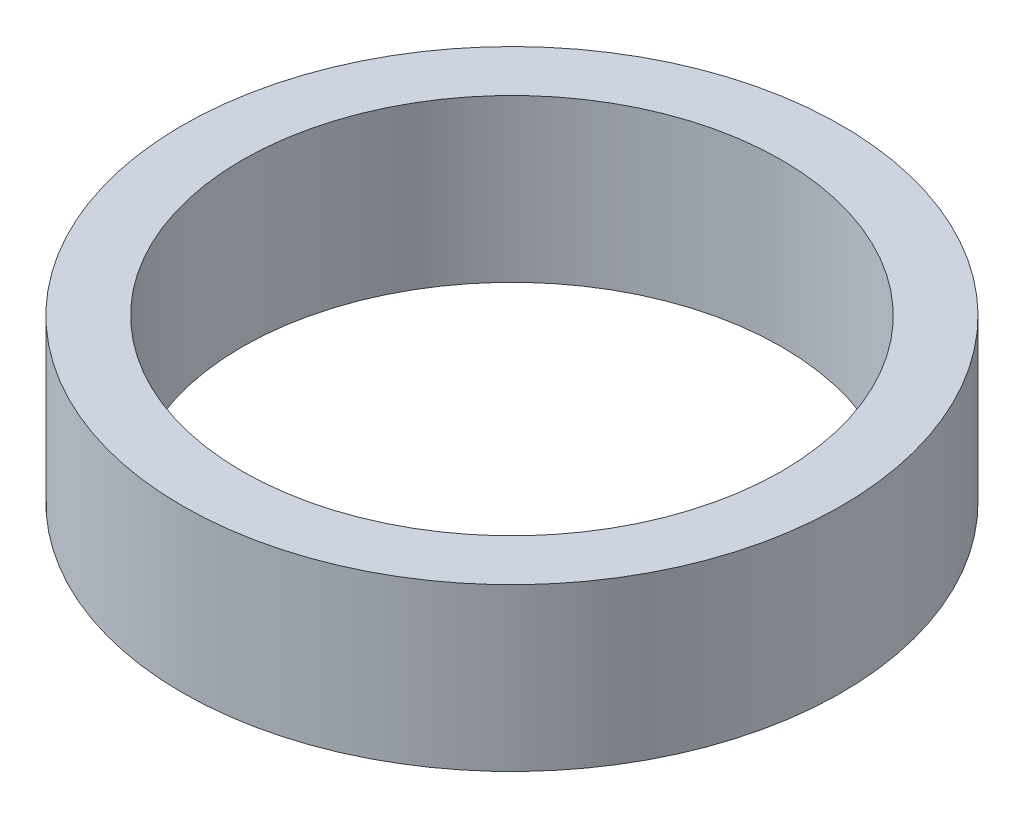
ISO-10303-21;
HEADER;
FILE_DESCRIPTION(('STEP AP214'),'2;1');
FILE_NAME('part.step','',(''),(''),'','','');
FILE_SCHEMA(('AUTOMOTIVE_DESIGN { 1 0 10303 214 1 1 1 1 }'));
ENDSEC;
DATA;
#1=APPLICATION_CONTEXT('core data for automotive mechanical design processes');
#2=APPLICATION_PROTOCOL_DEFINITION('international standard','automotive_design',2000,#1);
#3=PRODUCT_CONTEXT('',#1,'mechanical');
#4=PRODUCT('Part','Part','',(#3));
#5=PRODUCT_RELATED_PRODUCT_CATEGORY('part','',(#4));
#6=PRODUCT_DEFINITION_FORMATION('','',#4);
#7=PRODUCT_DEFINITION_CONTEXT('part definition',#1,'design');
#8=PRODUCT_DEFINITION('design','',#6,#7);
#9=PRODUCT_DEFINITION_SHAPE('','',#8);
#10=(LENGTH_UNIT() NAMED_UNIT(*) SI_UNIT(.MILLI.,.METRE.));
#11=(NAMED_UNIT(*) PLANE_ANGLE_UNIT() SI_UNIT($,.RADIAN.));
#12=(NAMED_UNIT(*) SI_UNIT($,.STERADIAN.) SOLID_ANGLE_UNIT());
#13=UNCERTAINTY_MEASURE_WITH_UNIT(LENGTH_MEASURE(1.E-05),#10,'distance_accuracy_value','');
#14=(GEOMETRIC_REPRESENTATION_CONTEXT(3) GLOBAL_UNCERTAINTY_ASSIGNED_CONTEXT((#13)) GLOBAL_UNIT_ASSIGNED_CONTEXT((#10,
#11,#12)) REPRESENTATION_CONTEXT('',''));
#15=CARTESIAN_POINT('',(0.,0.,0.));
#16=DIRECTION('',(0.,0.,1.));
#17=DIRECTION('',(1.,0.,0.));
#18=AXIS2_PLACEMENT_3D('',#15,#16,#17);
#19=CARTESIAN_POINT('',(0.,27.,0.));
#20=DIRECTION('',(0.,-1.,0.));
#21=DIRECTION('',(0.,0.,-1.));
#22=AXIS2_PLACEMENT_3D('',#19,#20,#21);
#23=CYLINDRICAL_SURFACE('',#22,55.);
#24=CARTESIAN_POINT('',(0.,27.,0.));
#25=DIRECTION('',(0.,1.,0.));
#26=DIRECTION('',(0.,0.,1.));
#27=AXIS2_PLACEMENT_3D('',#24,#25,#26);
#28=CIRCLE('',#27,55.);
#29=CARTESIAN_POINT('',(0.,27.,55.));
#30=VERTEX_POINT('',#29);
#31=EDGE_CURVE('E10',#30,#30,#28,.T.);
#32=ORIENTED_EDGE('',*,*,#31,.F.);
#33=EDGE_LOOP('',(#32));
#34=FACE_BOUND('',#33,.T.);
#35=CARTESIAN_POINT('',(0.,0.,0.));
#36=DIRECTION('',(0.,1.,0.));
#37=DIRECTION('',(0.,0.,1.));
#38=AXIS2_PLACEMENT_3D('',#35,#36,#37);
#39=CIRCLE('',#38,55.);
#40=CARTESIAN_POINT('',(0.,0.,55.));
#41=VERTEX_POINT('',#40);
#42=EDGE_CURVE('E37',#41,#41,#39,.T.);
#43=ORIENTED_EDGE('',*,*,#42,.T.);
#44=EDGE_LOOP('',(#43));
#45=FACE_BOUND('',#44,.T.);
#46=ADVANCED_FACE('F40',(#34,#45),#23,.T.);
#47=CARTESIAN_POINT('',(0.,27.,0.));
#48=DIRECTION('',(0.,1.,0.));
#49=DIRECTION('',(0.,0.,1.));
#50=AXIS2_PLACEMENT_3D('',#47,#48,#49);
#51=PLANE('',#50);
#52=CARTESIAN_POINT('',(0.,27.,0.));
#53=DIRECTION('',(0.,1.,0.));
#54=DIRECTION('',(0.,0.,1.));
#55=AXIS2_PLACEMENT_3D('',#52,#53,#54);
#56=CIRCLE('',#55,45.);
#57=CARTESIAN_POINT('',(0.,27.,45.));
#58=VERTEX_POINT('',#57);
#59=EDGE_CURVE('E50',#58,#58,#56,.T.);
#60=ORIENTED_EDGE('',*,*,#59,.F.);
#61=EDGE_LOOP('',(#60));
#62=FACE_BOUND('',#61,.T.);
#63=ORIENTED_EDGE('',*,*,#31,.T.);
#64=EDGE_LOOP('',(#63));
#65=FACE_BOUND('',#64,.T.);
#66=ADVANCED_FACE('F59',(#62,#65),#51,.T.);
#67=CARTESIAN_POINT('',(0.,0.,0.));
#68=DIRECTION('',(0.,1.,0.));
#69=DIRECTION('',(0.,0.,1.));
#70=AXIS2_PLACEMENT_3D('',#67,#68,#69);
#71=PLANE('',#70);
#72=CARTESIAN_POINT('',(0.,0.,0.));
#73=DIRECTION('',(0.,1.,0.));
#74=DIRECTION('',(0.,0.,1.));
#75=AXIS2_PLACEMENT_3D('',#72,#73,#74);
#76=CIRCLE('',#75,45.);
#77=CARTESIAN_POINT('',(0.,0.,45.));
#78=VERTEX_POINT('',#77);
#79=EDGE_CURVE('E47',#78,#78,#76,.T.);
#80=ORIENTED_EDGE('',*,*,#79,.T.);
#81=EDGE_LOOP('',(#80));
#82=FACE_BOUND('',#81,.T.);
#83=ORIENTED_EDGE('',*,*,#42,.F.);
#84=EDGE_LOOP('',(#83));
#85=FACE_BOUND('',#84,.T.);
#86=ADVANCED_FACE('F58',(#82,#85),#71,.F.);
#87=CARTESIAN_POINT('',(0.,27.,0.));
#88=DIRECTION('',(0.,-1.,0.));
#89=DIRECTION('',(0.,0.,-1.));
#90=AXIS2_PLACEMENT_3D('',#87,#88,#89);
#91=CYLINDRICAL_SURFACE('',#90,45.);
#92=ORIENTED_EDGE('',*,*,#59,.T.);
#93=EDGE_LOOP('',(#92));
#94=FACE_BOUND('',#93,.T.);
#95=ORIENTED_EDGE('',*,*,#79,.F.);
#96=EDGE_LOOP('',(#95));
#97=FACE_BOUND('',#96,.T.);
#98=ADVANCED_FACE('F54',(#94,#97),#91,.F.);
#99=CLOSED_SHELL('',(#46,#66,#86,#98));
#100=MANIFOLD_SOLID_BREP('B2',#99);
#101=ADVANCED_BREP_SHAPE_REPRESENTATION('',(#18,#100),#14);
#102=SHAPE_DEFINITION_REPRESENTATION(#9,#101);
ENDSEC;
END-ISO-10303-21;
